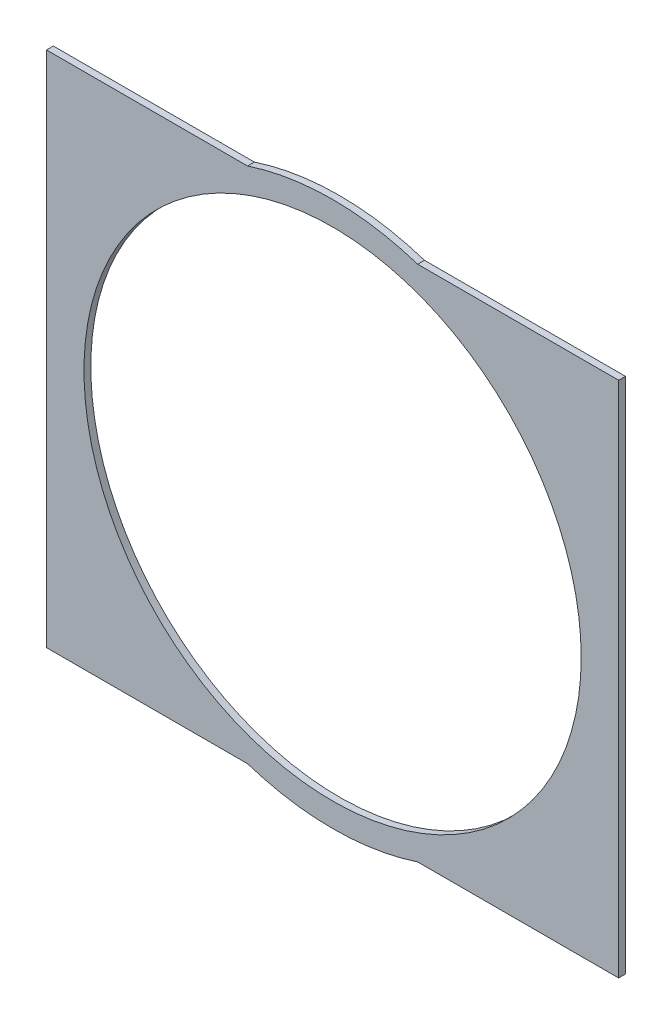
ISO-10303-21;
HEADER;
FILE_DESCRIPTION(('STEP AP214'),'2;1');
FILE_NAME('part.step','',(''),(''),'','','');
FILE_SCHEMA(('AUTOMOTIVE_DESIGN { 1 0 10303 214 1 1 1 1 }'));
ENDSEC;
DATA;
#1=APPLICATION_CONTEXT('core data for automotive mechanical design processes');
#2=APPLICATION_PROTOCOL_DEFINITION('international standard','automotive_design',2000,#1);
#3=PRODUCT_CONTEXT('',#1,'mechanical');
#4=PRODUCT('Part','Part','',(#3));
#5=PRODUCT_RELATED_PRODUCT_CATEGORY('part','',(#4));
#6=PRODUCT_DEFINITION_FORMATION('','',#4);
#7=PRODUCT_DEFINITION_CONTEXT('part definition',#1,'design');
#8=PRODUCT_DEFINITION('design','',#6,#7);
#9=PRODUCT_DEFINITION_SHAPE('','',#8);
#10=(LENGTH_UNIT() NAMED_UNIT(*) SI_UNIT(.MILLI.,.METRE.));
#11=(NAMED_UNIT(*) PLANE_ANGLE_UNIT() SI_UNIT($,.RADIAN.));
#12=(NAMED_UNIT(*) SI_UNIT($,.STERADIAN.) SOLID_ANGLE_UNIT());
#13=UNCERTAINTY_MEASURE_WITH_UNIT(LENGTH_MEASURE(1.E-05),#10,'distance_accuracy_value','');
#14=(GEOMETRIC_REPRESENTATION_CONTEXT(3) GLOBAL_UNCERTAINTY_ASSIGNED_CONTEXT((#13)) GLOBAL_UNIT_ASSIGNED_CONTEXT((#10,
#11,#12)) REPRESENTATION_CONTEXT('',''));
#15=CARTESIAN_POINT('',(0.,0.,0.));
#16=DIRECTION('',(0.,0.,1.));
#17=DIRECTION('',(1.,0.,0.));
#18=AXIS2_PLACEMENT_3D('',#15,#16,#17);
#19=CARTESIAN_POINT('',(-42.,38.,1.));
#20=DIRECTION('',(0.,0.,-1.));
#21=DIRECTION('',(-1.,0.,0.));
#22=AXIS2_PLACEMENT_3D('',#19,#20,#21);
#23=CYLINDRICAL_SURFACE('',#22,36.5);
#24=CARTESIAN_POINT('',(-42.,38.,1.));
#25=DIRECTION('',(0.,0.,1.));
#26=DIRECTION('',(1.,0.,0.));
#27=AXIS2_PLACEMENT_3D('',#24,#25,#26);
#28=CIRCLE('',#27,36.5);
#29=CARTESIAN_POINT('',(-5.50000000000001,38.,1.));
#30=VERTEX_POINT('',#29);
#31=EDGE_CURVE('E156',#30,#30,#28,.T.);
#32=ORIENTED_EDGE('',*,*,#31,.T.);
#33=EDGE_LOOP('',(#32));
#34=FACE_BOUND('',#33,.T.);
#35=CARTESIAN_POINT('',(-42.,38.,0.));
#36=DIRECTION('',(0.,0.,1.));
#37=DIRECTION('',(1.,0.,0.));
#38=AXIS2_PLACEMENT_3D('',#35,#36,#37);
#39=CIRCLE('',#38,36.5);
#40=CARTESIAN_POINT('',(-5.50000000000001,38.,0.));
#41=VERTEX_POINT('',#40);
#42=EDGE_CURVE('E187',#41,#41,#39,.T.);
#43=ORIENTED_EDGE('',*,*,#42,.F.);
#44=EDGE_LOOP('',(#43));
#45=FACE_BOUND('',#44,.T.);
#46=ADVANCED_FACE('F77',(#34,#45),#23,.F.);
#47=CARTESIAN_POINT('',(0.,0.,0.));
#48=DIRECTION('',(0.,0.,1.));
#49=DIRECTION('',(1.,0.,0.));
#50=AXIS2_PLACEMENT_3D('',#47,#48,#49);
#51=PLANE('',#50);
#52=ORIENTED_EDGE('',*,*,#42,.T.);
#53=EDGE_LOOP('',(#52));
#54=FACE_BOUND('',#53,.T.);
#55=DIRECTION('',(-1.,0.,0.));
#56=VECTOR('',#55,1.);
#57=CARTESIAN_POINT('',(0.,0.,0.));
#58=LINE('',#57,#56);
#59=CARTESIAN_POINT('',(0.,0.,0.));
#60=VERTEX_POINT('',#59);
#61=CARTESIAN_POINT('',(-29.5100040032032,0.,0.));
#62=VERTEX_POINT('',#61);
#63=EDGE_CURVE('E199',#60,#62,#58,.T.);
#64=ORIENTED_EDGE('',*,*,#63,.T.);
#65=CARTESIAN_POINT('',(-42.,38.,0.));
#66=DIRECTION('',(0.,0.,1.));
#67=DIRECTION('',(1.,0.,0.));
#68=AXIS2_PLACEMENT_3D('',#65,#66,#67);
#69=CIRCLE('',#68,40.);
#70=CARTESIAN_POINT('',(-54.4899959967968,0.,0.));
#71=VERTEX_POINT('',#70);
#72=EDGE_CURVE('E221',#71,#62,#69,.T.);
#73=ORIENTED_EDGE('',*,*,#72,.F.);
#74=CARTESIAN_POINT('',(-84.,0.,0.));
#75=VERTEX_POINT('',#74);
#76=EDGE_CURVE('E198',#71,#75,#58,.T.);
#77=ORIENTED_EDGE('',*,*,#76,.T.);
#78=DIRECTION('',(0.,1.,0.));
#79=VECTOR('',#78,1.);
#80=CARTESIAN_POINT('',(-84.,0.,0.));
#81=LINE('',#80,#79);
#82=CARTESIAN_POINT('',(-84.,76.,0.));
#83=VERTEX_POINT('',#82);
#84=EDGE_CURVE('E195',#75,#83,#81,.T.);
#85=ORIENTED_EDGE('',*,*,#84,.T.);
#86=DIRECTION('',(-1.,0.,0.));
#87=VECTOR('',#86,1.);
#88=CARTESIAN_POINT('',(0.,76.,0.));
#89=LINE('',#88,#87);
#90=CARTESIAN_POINT('',(-54.4899959967968,76.,0.));
#91=VERTEX_POINT('',#90);
#92=EDGE_CURVE('E162',#91,#83,#89,.T.);
#93=ORIENTED_EDGE('',*,*,#92,.F.);
#94=CARTESIAN_POINT('',(-29.5100040032032,76.,0.));
#95=VERTEX_POINT('',#94);
#96=EDGE_CURVE('E217',#95,#91,#69,.T.);
#97=ORIENTED_EDGE('',*,*,#96,.F.);
#98=CARTESIAN_POINT('',(0.,76.,0.));
#99=VERTEX_POINT('',#98);
#100=EDGE_CURVE('E191',#99,#95,#89,.T.);
#101=ORIENTED_EDGE('',*,*,#100,.F.);
#102=DIRECTION('',(0.,1.,0.));
#103=VECTOR('',#102,1.);
#104=CARTESIAN_POINT('',(0.,0.,0.));
#105=LINE('',#104,#103);
#106=EDGE_CURVE('E203',#60,#99,#105,.T.);
#107=ORIENTED_EDGE('',*,*,#106,.F.);
#108=EDGE_LOOP('',(#64,#73,#77,#85,#93,#97,#101,#107));
#109=FACE_BOUND('',#108,.T.);
#110=ADVANCED_FACE('F233',(#54,#109),#51,.F.);
#111=CARTESIAN_POINT('',(0.,0.,1.));
#112=DIRECTION('',(0.,0.,1.));
#113=DIRECTION('',(1.,0.,0.));
#114=AXIS2_PLACEMENT_3D('',#111,#112,#113);
#115=PLANE('',#114);
#116=DIRECTION('',(-1.,0.,0.));
#117=VECTOR('',#116,1.);
#118=CARTESIAN_POINT('',(0.,76.,1.));
#119=LINE('',#118,#117);
#120=CARTESIAN_POINT('',(0.,76.,1.));
#121=VERTEX_POINT('',#120);
#122=CARTESIAN_POINT('',(-29.5100040032032,76.,1.));
#123=VERTEX_POINT('',#122);
#124=EDGE_CURVE('E155',#121,#123,#119,.T.);
#125=ORIENTED_EDGE('',*,*,#124,.T.);
#126=CARTESIAN_POINT('',(-42.,38.,1.));
#127=DIRECTION('',(0.,0.,1.));
#128=DIRECTION('',(1.,0.,0.));
#129=AXIS2_PLACEMENT_3D('',#126,#127,#128);
#130=CIRCLE('',#129,40.);
#131=CARTESIAN_POINT('',(-54.4899959967968,76.,1.));
#132=VERTEX_POINT('',#131);
#133=EDGE_CURVE('E152',#123,#132,#130,.T.);
#134=ORIENTED_EDGE('',*,*,#133,.T.);
#135=CARTESIAN_POINT('',(-84.,76.,1.));
#136=VERTEX_POINT('',#135);
#137=EDGE_CURVE('E143',#132,#136,#119,.T.);
#138=ORIENTED_EDGE('',*,*,#137,.T.);
#139=DIRECTION('',(0.,1.,0.));
#140=VECTOR('',#139,1.);
#141=CARTESIAN_POINT('',(-84.,0.,1.));
#142=LINE('',#141,#140);
#143=CARTESIAN_POINT('',(-84.,0.,1.));
#144=VERTEX_POINT('',#143);
#145=EDGE_CURVE('E150',#144,#136,#142,.T.);
#146=ORIENTED_EDGE('',*,*,#145,.F.);
#147=DIRECTION('',(-1.,0.,0.));
#148=VECTOR('',#147,1.);
#149=CARTESIAN_POINT('',(0.,0.,1.));
#150=LINE('',#149,#148);
#151=CARTESIAN_POINT('',(-54.4899959967968,0.,1.));
#152=VERTEX_POINT('',#151);
#153=EDGE_CURVE('E173',#152,#144,#150,.T.);
#154=ORIENTED_EDGE('',*,*,#153,.F.);
#155=CARTESIAN_POINT('',(-29.5100040032032,0.,1.));
#156=VERTEX_POINT('',#155);
#157=EDGE_CURVE('E216',#152,#156,#130,.T.);
#158=ORIENTED_EDGE('',*,*,#157,.T.);
#159=CARTESIAN_POINT('',(0.,0.,1.));
#160=VERTEX_POINT('',#159);
#161=EDGE_CURVE('E177',#160,#156,#150,.T.);
#162=ORIENTED_EDGE('',*,*,#161,.F.);
#163=DIRECTION('',(0.,1.,0.));
#164=VECTOR('',#163,1.);
#165=CARTESIAN_POINT('',(0.,0.,1.));
#166=LINE('',#165,#164);
#167=EDGE_CURVE('E183',#160,#121,#166,.T.);
#168=ORIENTED_EDGE('',*,*,#167,.T.);
#169=EDGE_LOOP('',(#125,#134,#138,#146,#154,#158,#162,#168));
#170=FACE_BOUND('',#169,.T.);
#171=ORIENTED_EDGE('',*,*,#31,.F.);
#172=EDGE_LOOP('',(#171));
#173=FACE_BOUND('',#172,.T.);
#174=ADVANCED_FACE('F146',(#170,#173),#115,.T.);
#175=CARTESIAN_POINT('',(0.,0.,1.));
#176=DIRECTION('',(0.,-1.,0.));
#177=DIRECTION('',(1.,0.,0.));
#178=AXIS2_PLACEMENT_3D('',#175,#176,#177);
#179=PLANE('',#178);
#180=ORIENTED_EDGE('',*,*,#161,.T.);
#181=DIRECTION('',(0.,0.,-1.));
#182=VECTOR('',#181,1.);
#183=CARTESIAN_POINT('',(-29.5100040032032,0.,1.));
#184=LINE('',#183,#182);
#185=EDGE_CURVE('E100',#156,#62,#184,.T.);
#186=ORIENTED_EDGE('',*,*,#185,.T.);
#187=ORIENTED_EDGE('',*,*,#63,.F.);
#188=DIRECTION('',(0.,0.,-1.));
#189=VECTOR('',#188,1.);
#190=CARTESIAN_POINT('',(0.,0.,1.));
#191=LINE('',#190,#189);
#192=EDGE_CURVE('E209',#160,#60,#191,.T.);
#193=ORIENTED_EDGE('',*,*,#192,.F.);
#194=EDGE_LOOP('',(#180,#186,#187,#193));
#195=FACE_BOUND('',#194,.T.);
#196=ADVANCED_FACE('F244',(#195),#179,.T.);
#197=CARTESIAN_POINT('',(0.,0.,1.));
#198=DIRECTION('',(-1.,0.,0.));
#199=DIRECTION('',(0.,-1.,0.));
#200=AXIS2_PLACEMENT_3D('',#197,#198,#199);
#201=PLANE('',#200);
#202=ORIENTED_EDGE('',*,*,#106,.T.);
#203=DIRECTION('',(0.,0.,-1.));
#204=VECTOR('',#203,1.);
#205=CARTESIAN_POINT('',(0.,76.,1.));
#206=LINE('',#205,#204);
#207=EDGE_CURVE('E186',#121,#99,#206,.T.);
#208=ORIENTED_EDGE('',*,*,#207,.F.);
#209=ORIENTED_EDGE('',*,*,#167,.F.);
#210=ORIENTED_EDGE('',*,*,#192,.T.);
#211=EDGE_LOOP('',(#202,#208,#209,#210));
#212=FACE_BOUND('',#211,.T.);
#213=ADVANCED_FACE('F239',(#212),#201,.F.);
#214=CARTESIAN_POINT('',(0.,76.,1.));
#215=DIRECTION('',(0.,-1.,0.));
#216=DIRECTION('',(1.,0.,0.));
#217=AXIS2_PLACEMENT_3D('',#214,#215,#216);
#218=PLANE('',#217);
#219=DIRECTION('',(0.,0.,-1.));
#220=VECTOR('',#219,1.);
#221=CARTESIAN_POINT('',(-29.5100040032032,76.,1.));
#222=LINE('',#221,#220);
#223=EDGE_CURVE('E86',#123,#95,#222,.T.);
#224=ORIENTED_EDGE('',*,*,#223,.F.);
#225=ORIENTED_EDGE('',*,*,#124,.F.);
#226=ORIENTED_EDGE('',*,*,#207,.T.);
#227=ORIENTED_EDGE('',*,*,#100,.T.);
#228=EDGE_LOOP('',(#224,#225,#226,#227));
#229=FACE_BOUND('',#228,.T.);
#230=ADVANCED_FACE('F235',(#229),#218,.F.);
#231=DIRECTION('',(0.,0.,-1.));
#232=VECTOR('',#231,1.);
#233=CARTESIAN_POINT('',(-54.4899959967968,76.,1.));
#234=LINE('',#233,#232);
#235=EDGE_CURVE('E12',#91,#132,#234,.F.);
#236=ORIENTED_EDGE('',*,*,#235,.F.);
#237=ORIENTED_EDGE('',*,*,#92,.T.);
#238=DIRECTION('',(0.,0.,-1.));
#239=VECTOR('',#238,1.);
#240=CARTESIAN_POINT('',(-84.,76.,1.));
#241=LINE('',#240,#239);
#242=EDGE_CURVE('E159',#136,#83,#241,.T.);
#243=ORIENTED_EDGE('',*,*,#242,.F.);
#244=ORIENTED_EDGE('',*,*,#137,.F.);
#245=EDGE_LOOP('',(#236,#237,#243,#244));
#246=FACE_BOUND('',#245,.T.);
#247=ADVANCED_FACE('F160',(#246),#218,.F.);
#248=CARTESIAN_POINT('',(-84.,0.,1.));
#249=DIRECTION('',(-1.,0.,0.));
#250=DIRECTION('',(0.,0.,1.));
#251=AXIS2_PLACEMENT_3D('',#248,#249,#250);
#252=PLANE('',#251);
#253=ORIENTED_EDGE('',*,*,#84,.F.);
#254=DIRECTION('',(0.,0.,-1.));
#255=VECTOR('',#254,1.);
#256=CARTESIAN_POINT('',(-84.,0.,1.));
#257=LINE('',#256,#255);
#258=EDGE_CURVE('E167',#144,#75,#257,.T.);
#259=ORIENTED_EDGE('',*,*,#258,.F.);
#260=ORIENTED_EDGE('',*,*,#145,.T.);
#261=ORIENTED_EDGE('',*,*,#242,.T.);
#262=EDGE_LOOP('',(#253,#259,#260,#261));
#263=FACE_BOUND('',#262,.T.);
#264=ADVANCED_FACE('F170',(#263),#252,.T.);
#265=ORIENTED_EDGE('',*,*,#76,.F.);
#266=DIRECTION('',(0.,0.,-1.));
#267=VECTOR('',#266,1.);
#268=CARTESIAN_POINT('',(-54.4899959967968,0.,1.));
#269=LINE('',#268,#267);
#270=EDGE_CURVE('E93',#71,#152,#269,.F.);
#271=ORIENTED_EDGE('',*,*,#270,.T.);
#272=ORIENTED_EDGE('',*,*,#153,.T.);
#273=ORIENTED_EDGE('',*,*,#258,.T.);
#274=EDGE_LOOP('',(#265,#271,#272,#273));
#275=FACE_BOUND('',#274,.T.);
#276=ADVANCED_FACE('F256',(#275),#179,.T.);
#277=CARTESIAN_POINT('',(-42.,38.,1.));
#278=DIRECTION('',(0.,0.,-1.));
#279=DIRECTION('',(-1.,0.,0.));
#280=AXIS2_PLACEMENT_3D('',#277,#278,#279);
#281=CYLINDRICAL_SURFACE('',#280,40.);
#282=ORIENTED_EDGE('',*,*,#270,.F.);
#283=ORIENTED_EDGE('',*,*,#72,.T.);
#284=ORIENTED_EDGE('',*,*,#185,.F.);
#285=ORIENTED_EDGE('',*,*,#157,.F.);
#286=EDGE_LOOP('',(#282,#283,#284,#285));
#287=FACE_BOUND('',#286,.T.);
#288=ADVANCED_FACE('F79',(#287),#281,.T.);
#289=ORIENTED_EDGE('',*,*,#96,.T.);
#290=ORIENTED_EDGE('',*,*,#235,.T.);
#291=ORIENTED_EDGE('',*,*,#133,.F.);
#292=ORIENTED_EDGE('',*,*,#223,.T.);
#293=EDGE_LOOP('',(#289,#290,#291,#292));
#294=FACE_BOUND('',#293,.T.);
#295=ADVANCED_FACE('F228',(#294),#281,.T.);
#296=CLOSED_SHELL('',(#46,#110,#174,#196,#213,#230,#247,#264,#276,#288,#295));
#297=MANIFOLD_SOLID_BREP('B2',#296);
#298=ADVANCED_BREP_SHAPE_REPRESENTATION('',(#18,#297),#14);
#299=SHAPE_DEFINITION_REPRESENTATION(#9,#298);
ENDSEC;
END-ISO-10303-21;
